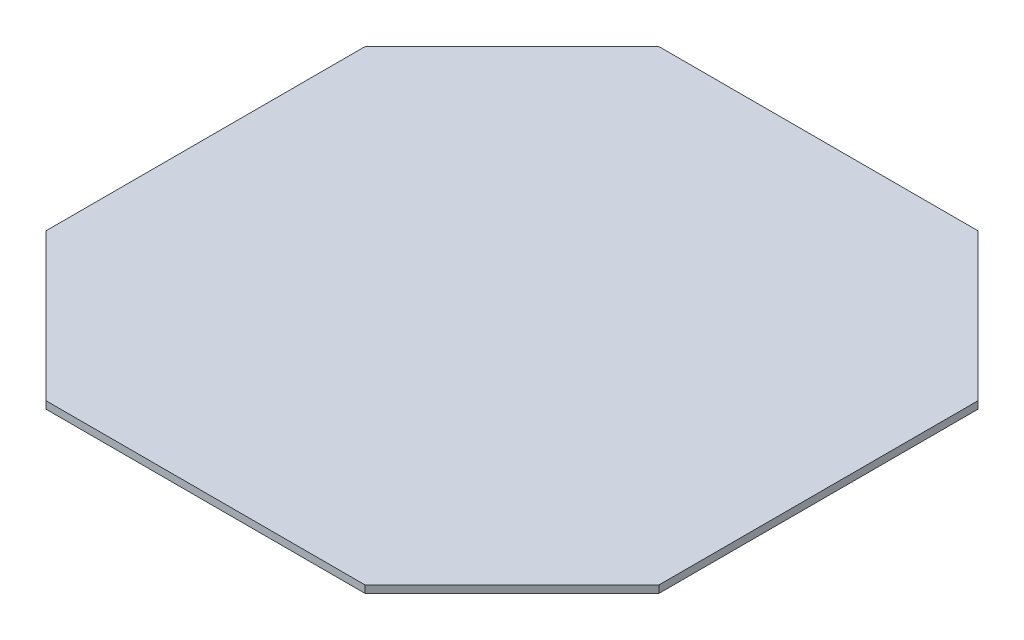
ISO-10303-21;
HEADER;
FILE_DESCRIPTION(('STEP AP214'),'2;1');
FILE_NAME('part.step','',(''),(''),'','','');
FILE_SCHEMA(('AUTOMOTIVE_DESIGN { 1 0 10303 214 1 1 1 1 }'));
ENDSEC;
DATA;
#1=APPLICATION_CONTEXT('core data for automotive mechanical design processes');
#2=APPLICATION_PROTOCOL_DEFINITION('international standard','automotive_design',2000,#1);
#3=PRODUCT_CONTEXT('',#1,'mechanical');
#4=PRODUCT('Part','Part','',(#3));
#5=PRODUCT_RELATED_PRODUCT_CATEGORY('part','',(#4));
#6=PRODUCT_DEFINITION_FORMATION('','',#4);
#7=PRODUCT_DEFINITION_CONTEXT('part definition',#1,'design');
#8=PRODUCT_DEFINITION('design','',#6,#7);
#9=PRODUCT_DEFINITION_SHAPE('','',#8);
#10=(LENGTH_UNIT() NAMED_UNIT(*) SI_UNIT(.MILLI.,.METRE.));
#11=(NAMED_UNIT(*) PLANE_ANGLE_UNIT() SI_UNIT($,.RADIAN.));
#12=(NAMED_UNIT(*) SI_UNIT($,.STERADIAN.) SOLID_ANGLE_UNIT());
#13=UNCERTAINTY_MEASURE_WITH_UNIT(LENGTH_MEASURE(1.E-05),#10,'distance_accuracy_value','');
#14=(GEOMETRIC_REPRESENTATION_CONTEXT(3) GLOBAL_UNCERTAINTY_ASSIGNED_CONTEXT((#13)) GLOBAL_UNIT_ASSIGNED_CONTEXT((#10,
#11,#12)) REPRESENTATION_CONTEXT('',''));
#15=CARTESIAN_POINT('',(0.,0.,0.));
#16=DIRECTION('',(0.,0.,1.));
#17=DIRECTION('',(1.,0.,0.));
#18=AXIS2_PLACEMENT_3D('',#15,#16,#17);
#19=CARTESIAN_POINT('',(125.,3.,125.));
#20=DIRECTION('',(0.,0.,-1.));
#21=DIRECTION('',(-1.,0.,0.));
#22=AXIS2_PLACEMENT_3D('',#19,#20,#21);
#23=PLANE('',#22);
#24=DIRECTION('',(0.,1.,0.));
#25=VECTOR('',#24,1.);
#26=CARTESIAN_POINT('',(-65.0000000000001,-10.,125.));
#27=LINE('',#26,#25);
#28=CARTESIAN_POINT('',(-65.0000000000001,0.,125.));
#29=VERTEX_POINT('',#28);
#30=CARTESIAN_POINT('',(-65.0000000000001,3.,125.));
#31=VERTEX_POINT('',#30);
#32=EDGE_CURVE('E94',#29,#31,#27,.T.);
#33=ORIENTED_EDGE('',*,*,#32,.F.);
#34=DIRECTION('',(1.,0.,0.));
#35=VECTOR('',#34,1.);
#36=CARTESIAN_POINT('',(125.,0.,125.));
#37=LINE('',#36,#35);
#38=CARTESIAN_POINT('',(65.,0.,125.));
#39=VERTEX_POINT('',#38);
#40=EDGE_CURVE('E53',#29,#39,#37,.T.);
#41=ORIENTED_EDGE('',*,*,#40,.T.);
#42=DIRECTION('',(0.,1.,0.));
#43=VECTOR('',#42,1.);
#44=CARTESIAN_POINT('',(65.,-10.,125.));
#45=LINE('',#44,#43);
#46=CARTESIAN_POINT('',(65.,3.,125.));
#47=VERTEX_POINT('',#46);
#48=EDGE_CURVE('E110',#39,#47,#45,.T.);
#49=ORIENTED_EDGE('',*,*,#48,.T.);
#50=DIRECTION('',(1.,0.,0.));
#51=VECTOR('',#50,1.);
#52=CARTESIAN_POINT('',(125.,3.,125.));
#53=LINE('',#52,#51);
#54=EDGE_CURVE('E104',#31,#47,#53,.T.);
#55=ORIENTED_EDGE('',*,*,#54,.F.);
#56=EDGE_LOOP('',(#33,#41,#49,#55));
#57=FACE_BOUND('',#56,.T.);
#58=ADVANCED_FACE('F31',(#57),#23,.F.);
#59=CARTESIAN_POINT('',(-125.,3.,-125.));
#60=DIRECTION('',(0.,1.,0.));
#61=DIRECTION('',(0.,0.,1.));
#62=AXIS2_PLACEMENT_3D('',#59,#60,#61);
#63=PLANE('',#62);
#64=DIRECTION('',(0.,0.,1.));
#65=VECTOR('',#64,1.);
#66=CARTESIAN_POINT('',(-125.,3.,125.));
#67=LINE('',#66,#65);
#68=CARTESIAN_POINT('',(-125.,3.,-65.));
#69=VERTEX_POINT('',#68);
#70=CARTESIAN_POINT('',(-125.,3.,65.0000000000001));
#71=VERTEX_POINT('',#70);
#72=EDGE_CURVE('E108',#69,#71,#67,.T.);
#73=ORIENTED_EDGE('',*,*,#72,.T.);
#74=DIRECTION('',(0.707106781186548,0.,0.707106781186547));
#75=VECTOR('',#74,1.);
#76=CARTESIAN_POINT('',(-232.570710678119,3.,-42.5707106781185));
#77=LINE('',#76,#75);
#78=EDGE_CURVE('E45',#71,#31,#77,.T.);
#79=ORIENTED_EDGE('',*,*,#78,.T.);
#80=ORIENTED_EDGE('',*,*,#54,.T.);
#81=DIRECTION('',(0.707106781186548,0.,-0.707106781186547));
#82=VECTOR('',#81,1.);
#83=CARTESIAN_POINT('',(-42.5707106781188,3.,232.570710678119));
#84=LINE('',#83,#82);
#85=CARTESIAN_POINT('',(125.,3.,65.));
#86=VERTEX_POINT('',#85);
#87=EDGE_CURVE('E174',#47,#86,#84,.T.);
#88=ORIENTED_EDGE('',*,*,#87,.T.);
#89=DIRECTION('',(0.,0.,-1.));
#90=VECTOR('',#89,1.);
#91=CARTESIAN_POINT('',(125.,3.,125.));
#92=LINE('',#91,#90);
#93=CARTESIAN_POINT('',(125.,3.,-64.9999999999999));
#94=VERTEX_POINT('',#93);
#95=EDGE_CURVE('E111',#86,#94,#92,.T.);
#96=ORIENTED_EDGE('',*,*,#95,.T.);
#97=DIRECTION('',(0.707106781186548,0.,0.707106781186548));
#98=VECTOR('',#97,1.);
#99=CARTESIAN_POINT('',(-42.5707106781187,3.,-232.570710678119));
#100=LINE('',#99,#98);
#101=CARTESIAN_POINT('',(64.9999999999998,3.,-125.));
#102=VERTEX_POINT('',#101);
#103=EDGE_CURVE('E145',#102,#94,#100,.T.);
#104=ORIENTED_EDGE('',*,*,#103,.F.);
#105=DIRECTION('',(-1.,0.,0.));
#106=VECTOR('',#105,1.);
#107=CARTESIAN_POINT('',(125.,3.,-125.));
#108=LINE('',#107,#106);
#109=CARTESIAN_POINT('',(-64.9999999999999,3.,-125.));
#110=VERTEX_POINT('',#109);
#111=EDGE_CURVE('E113',#102,#110,#108,.T.);
#112=ORIENTED_EDGE('',*,*,#111,.T.);
#113=DIRECTION('',(0.707106781186548,0.,-0.707106781186548));
#114=VECTOR('',#113,1.);
#115=CARTESIAN_POINT('',(-232.570710678119,3.,42.5707106781186));
#116=LINE('',#115,#114);
#117=EDGE_CURVE('E162',#69,#110,#116,.T.);
#118=ORIENTED_EDGE('',*,*,#117,.F.);
#119=EDGE_LOOP('',(#73,#79,#80,#88,#96,#104,#112,#118));
#120=FACE_BOUND('',#119,.T.);
#121=ADVANCED_FACE('F102',(#120),#63,.T.);
#122=CARTESIAN_POINT('',(-125.,0.,-125.));
#123=DIRECTION('',(0.,1.,0.));
#124=DIRECTION('',(0.,0.,1.));
#125=AXIS2_PLACEMENT_3D('',#122,#123,#124);
#126=PLANE('',#125);
#127=DIRECTION('',(0.707106781186548,0.,0.707106781186547));
#128=VECTOR('',#127,1.);
#129=CARTESIAN_POINT('',(-220.,0.,-29.9999999999999));
#130=LINE('',#129,#128);
#131=CARTESIAN_POINT('',(-125.,0.,65.0000000000001));
#132=VERTEX_POINT('',#131);
#133=EDGE_CURVE('E97',#132,#29,#130,.T.);
#134=ORIENTED_EDGE('',*,*,#133,.F.);
#135=DIRECTION('',(0.,0.,1.));
#136=VECTOR('',#135,1.);
#137=CARTESIAN_POINT('',(-125.,0.,125.));
#138=LINE('',#137,#136);
#139=CARTESIAN_POINT('',(-125.,0.,-65.));
#140=VERTEX_POINT('',#139);
#141=EDGE_CURVE('E121',#140,#132,#138,.T.);
#142=ORIENTED_EDGE('',*,*,#141,.F.);
#143=DIRECTION('',(0.707106781186548,0.,-0.707106781186548));
#144=VECTOR('',#143,1.);
#145=CARTESIAN_POINT('',(-95.,0.,-95.));
#146=LINE('',#145,#144);
#147=CARTESIAN_POINT('',(-64.9999999999999,0.,-125.));
#148=VERTEX_POINT('',#147);
#149=EDGE_CURVE('E120',#140,#148,#146,.T.);
#150=ORIENTED_EDGE('',*,*,#149,.T.);
#151=DIRECTION('',(-1.,0.,0.));
#152=VECTOR('',#151,1.);
#153=CARTESIAN_POINT('',(125.,0.,-125.));
#154=LINE('',#153,#152);
#155=CARTESIAN_POINT('',(64.9999999999998,0.,-125.));
#156=VERTEX_POINT('',#155);
#157=EDGE_CURVE('E115',#156,#148,#154,.T.);
#158=ORIENTED_EDGE('',*,*,#157,.F.);
#159=DIRECTION('',(0.707106781186548,0.,0.707106781186548));
#160=VECTOR('',#159,1.);
#161=CARTESIAN_POINT('',(-30.,0.,-220.));
#162=LINE('',#161,#160);
#163=CARTESIAN_POINT('',(125.,0.,-64.9999999999998));
#164=VERTEX_POINT('',#163);
#165=EDGE_CURVE('E131',#156,#164,#162,.T.);
#166=ORIENTED_EDGE('',*,*,#165,.T.);
#167=DIRECTION('',(0.,0.,-1.));
#168=VECTOR('',#167,1.);
#169=CARTESIAN_POINT('',(125.,0.,125.));
#170=LINE('',#169,#168);
#171=CARTESIAN_POINT('',(125.,0.,65.));
#172=VERTEX_POINT('',#171);
#173=EDGE_CURVE('E126',#172,#164,#170,.T.);
#174=ORIENTED_EDGE('',*,*,#173,.F.);
#175=DIRECTION('',(0.707106781186548,0.,-0.707106781186547));
#176=VECTOR('',#175,1.);
#177=CARTESIAN_POINT('',(94.9999999999999,0.,95.0000000000001));
#178=LINE('',#177,#176);
#179=EDGE_CURVE('E39',#39,#172,#178,.T.);
#180=ORIENTED_EDGE('',*,*,#179,.F.);
#181=ORIENTED_EDGE('',*,*,#40,.F.);
#182=EDGE_LOOP('',(#134,#142,#150,#158,#166,#174,#180,#181));
#183=FACE_BOUND('',#182,.T.);
#184=ADVANCED_FACE('F147',(#183),#126,.F.);
#185=CARTESIAN_POINT('',(-125.,3.,125.));
#186=DIRECTION('',(1.,0.,0.));
#187=DIRECTION('',(0.,0.,-1.));
#188=AXIS2_PLACEMENT_3D('',#185,#186,#187);
#189=PLANE('',#188);
#190=DIRECTION('',(0.,-1.,0.));
#191=VECTOR('',#190,1.);
#192=CARTESIAN_POINT('',(-125.,3.,65.0000000000001));
#193=LINE('',#192,#191);
#194=EDGE_CURVE('E11',#71,#132,#193,.T.);
#195=ORIENTED_EDGE('',*,*,#194,.F.);
#196=ORIENTED_EDGE('',*,*,#72,.F.);
#197=DIRECTION('',(0.,1.,0.));
#198=VECTOR('',#197,1.);
#199=CARTESIAN_POINT('',(-125.,-10.,-65.));
#200=LINE('',#199,#198);
#201=EDGE_CURVE('E168',#140,#69,#200,.T.);
#202=ORIENTED_EDGE('',*,*,#201,.F.);
#203=ORIENTED_EDGE('',*,*,#141,.T.);
#204=EDGE_LOOP('',(#195,#196,#202,#203));
#205=FACE_BOUND('',#204,.T.);
#206=ADVANCED_FACE('F33',(#205),#189,.F.);
#207=CARTESIAN_POINT('',(125.,3.,125.));
#208=DIRECTION('',(-1.,0.,0.));
#209=DIRECTION('',(0.,0.,1.));
#210=AXIS2_PLACEMENT_3D('',#207,#208,#209);
#211=PLANE('',#210);
#212=DIRECTION('',(0.,1.,0.));
#213=VECTOR('',#212,1.);
#214=CARTESIAN_POINT('',(125.,-10.,65.));
#215=LINE('',#214,#213);
#216=EDGE_CURVE('E137',#172,#86,#215,.T.);
#217=ORIENTED_EDGE('',*,*,#216,.F.);
#218=ORIENTED_EDGE('',*,*,#173,.T.);
#219=DIRECTION('',(0.,1.,0.));
#220=VECTOR('',#219,1.);
#221=CARTESIAN_POINT('',(125.,-10.,-64.9999999999999));
#222=LINE('',#221,#220);
#223=EDGE_CURVE('E155',#164,#94,#222,.T.);
#224=ORIENTED_EDGE('',*,*,#223,.T.);
#225=ORIENTED_EDGE('',*,*,#95,.F.);
#226=EDGE_LOOP('',(#217,#218,#224,#225));
#227=FACE_BOUND('',#226,.T.);
#228=ADVANCED_FACE('F142',(#227),#211,.F.);
#229=CARTESIAN_POINT('',(125.,3.,-125.));
#230=DIRECTION('',(0.,0.,1.));
#231=DIRECTION('',(1.,0.,0.));
#232=AXIS2_PLACEMENT_3D('',#229,#230,#231);
#233=PLANE('',#232);
#234=ORIENTED_EDGE('',*,*,#111,.F.);
#235=DIRECTION('',(0.,1.,0.));
#236=VECTOR('',#235,1.);
#237=CARTESIAN_POINT('',(64.9999999999998,-10.,-125.));
#238=LINE('',#237,#236);
#239=EDGE_CURVE('E153',#156,#102,#238,.T.);
#240=ORIENTED_EDGE('',*,*,#239,.F.);
#241=ORIENTED_EDGE('',*,*,#157,.T.);
#242=DIRECTION('',(0.,1.,0.));
#243=VECTOR('',#242,1.);
#244=CARTESIAN_POINT('',(-64.9999999999999,-10.,-125.));
#245=LINE('',#244,#243);
#246=EDGE_CURVE('E124',#148,#110,#245,.T.);
#247=ORIENTED_EDGE('',*,*,#246,.T.);
#248=EDGE_LOOP('',(#234,#240,#241,#247));
#249=FACE_BOUND('',#248,.T.);
#250=ADVANCED_FACE('F158',(#249),#233,.F.);
#251=CARTESIAN_POINT('',(-232.570710678119,-10.,42.5707106781186));
#252=DIRECTION('',(0.707106781186548,0.,0.707106781186548));
#253=DIRECTION('',(0.707106781186548,0.,-0.707106781186548));
#254=AXIS2_PLACEMENT_3D('',#251,#252,#253);
#255=PLANE('',#254);
#256=ORIENTED_EDGE('',*,*,#201,.T.);
#257=ORIENTED_EDGE('',*,*,#117,.T.);
#258=ORIENTED_EDGE('',*,*,#246,.F.);
#259=ORIENTED_EDGE('',*,*,#149,.F.);
#260=EDGE_LOOP('',(#256,#257,#258,#259));
#261=FACE_BOUND('',#260,.T.);
#262=ADVANCED_FACE('F171',(#261),#255,.F.);
#263=CARTESIAN_POINT('',(-42.5707106781187,-10.,-232.570710678119));
#264=DIRECTION('',(-0.707106781186548,0.,0.707106781186548));
#265=DIRECTION('',(0.707106781186548,0.,0.707106781186548));
#266=AXIS2_PLACEMENT_3D('',#263,#264,#265);
#267=PLANE('',#266);
#268=ORIENTED_EDGE('',*,*,#239,.T.);
#269=ORIENTED_EDGE('',*,*,#103,.T.);
#270=ORIENTED_EDGE('',*,*,#223,.F.);
#271=ORIENTED_EDGE('',*,*,#165,.F.);
#272=EDGE_LOOP('',(#268,#269,#270,#271));
#273=FACE_BOUND('',#272,.T.);
#274=ADVANCED_FACE('F151',(#273),#267,.F.);
#275=CARTESIAN_POINT('',(-42.5707106781188,-10.,232.570710678119));
#276=DIRECTION('',(0.707106781186547,0.,0.707106781186548));
#277=DIRECTION('',(0.707106781186548,0.,-0.707106781186547));
#278=AXIS2_PLACEMENT_3D('',#275,#276,#277);
#279=PLANE('',#278);
#280=ORIENTED_EDGE('',*,*,#179,.T.);
#281=ORIENTED_EDGE('',*,*,#216,.T.);
#282=ORIENTED_EDGE('',*,*,#87,.F.);
#283=ORIENTED_EDGE('',*,*,#48,.F.);
#284=EDGE_LOOP('',(#280,#281,#282,#283));
#285=FACE_BOUND('',#284,.T.);
#286=ADVANCED_FACE('F136',(#285),#279,.T.);
#287=CARTESIAN_POINT('',(-232.570710678119,-10.,-42.5707106781185));
#288=DIRECTION('',(-0.707106781186547,0.,0.707106781186548));
#289=DIRECTION('',(0.707106781186548,0.,0.707106781186547));
#290=AXIS2_PLACEMENT_3D('',#287,#288,#289);
#291=PLANE('',#290);
#292=ORIENTED_EDGE('',*,*,#133,.T.);
#293=ORIENTED_EDGE('',*,*,#32,.T.);
#294=ORIENTED_EDGE('',*,*,#78,.F.);
#295=ORIENTED_EDGE('',*,*,#194,.T.);
#296=EDGE_LOOP('',(#292,#293,#294,#295));
#297=FACE_BOUND('',#296,.T.);
#298=ADVANCED_FACE('F95',(#297),#291,.T.);
#299=CLOSED_SHELL('',(#58,#121,#184,#206,#228,#250,#262,#274,#286,#298));
#300=MANIFOLD_SOLID_BREP('B2',#299);
#301=ADVANCED_BREP_SHAPE_REPRESENTATION('',(#18,#300),#14);
#302=SHAPE_DEFINITION_REPRESENTATION(#9,#301);
ENDSEC;
END-ISO-10303-21;
